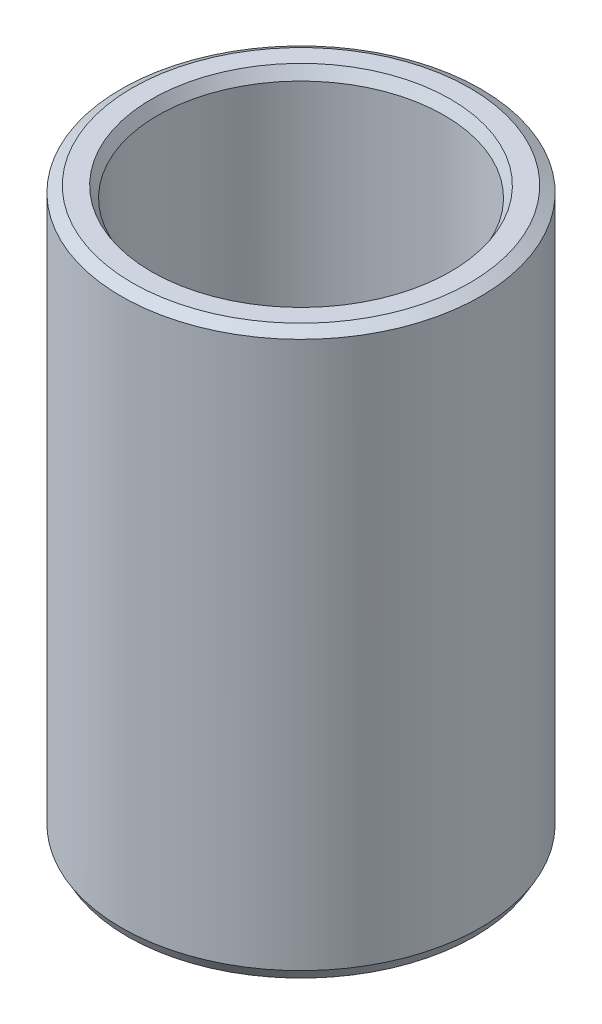
ISO-10303-21;
HEADER;
FILE_DESCRIPTION(('STEP AP214'),'2;1');
FILE_NAME('part.step','',(''),(''),'','','');
FILE_SCHEMA(('AUTOMOTIVE_DESIGN { 1 0 10303 214 1 1 1 1 }'));
ENDSEC;
DATA;
#1=APPLICATION_CONTEXT('core data for automotive mechanical design processes');
#2=APPLICATION_PROTOCOL_DEFINITION('international standard','automotive_design',2000,#1);
#3=PRODUCT_CONTEXT('',#1,'mechanical');
#4=PRODUCT('Part','Part','',(#3));
#5=PRODUCT_RELATED_PRODUCT_CATEGORY('part','',(#4));
#6=PRODUCT_DEFINITION_FORMATION('','',#4);
#7=PRODUCT_DEFINITION_CONTEXT('part definition',#1,'design');
#8=PRODUCT_DEFINITION('design','',#6,#7);
#9=PRODUCT_DEFINITION_SHAPE('','',#8);
#10=(LENGTH_UNIT() NAMED_UNIT(*) SI_UNIT(.MILLI.,.METRE.));
#11=(NAMED_UNIT(*) PLANE_ANGLE_UNIT() SI_UNIT($,.RADIAN.));
#12=(NAMED_UNIT(*) SI_UNIT($,.STERADIAN.) SOLID_ANGLE_UNIT());
#13=UNCERTAINTY_MEASURE_WITH_UNIT(LENGTH_MEASURE(1.E-05),#10,'distance_accuracy_value','');
#14=(GEOMETRIC_REPRESENTATION_CONTEXT(3) GLOBAL_UNCERTAINTY_ASSIGNED_CONTEXT((#13)) GLOBAL_UNIT_ASSIGNED_CONTEXT((#10,
#11,#12)) REPRESENTATION_CONTEXT('',''));
#15=CARTESIAN_POINT('',(0.,0.,0.));
#16=DIRECTION('',(0.,0.,1.));
#17=DIRECTION('',(1.,0.,0.));
#18=AXIS2_PLACEMENT_3D('',#15,#16,#17);
#19=CARTESIAN_POINT('',(0.,78.4503649466018,0.));
#20=DIRECTION('',(0.,-1.,0.));
#21=DIRECTION('',(0.,0.,-1.));
#22=AXIS2_PLACEMENT_3D('',#19,#20,#21);
#23=CYLINDRICAL_SURFACE('',#22,25.);
#24=CARTESIAN_POINT('',(0.,1.51550329180392,0.));
#25=DIRECTION('',(0.,1.,0.));
#26=DIRECTION('',(0.,0.,1.));
#27=AXIS2_PLACEMENT_3D('',#24,#25,#26);
#28=CIRCLE('',#27,25.);
#29=CARTESIAN_POINT('',(0.,1.51550329180392,-25.));
#30=VERTEX_POINT('',#29);
#31=EDGE_CURVE('E10',#30,#30,#28,.T.);
#32=CARTESIAN_POINT('',(0.,77.5753887131211,0.));
#33=DIRECTION('',(0.,1.,0.));
#34=DIRECTION('',(0.,0.,1.));
#35=AXIS2_PLACEMENT_3D('',#32,#33,#34);
#36=CIRCLE('',#35,25.);
#37=CARTESIAN_POINT('',(0.,77.5753887131211,-25.));
#38=VERTEX_POINT('',#37);
#39=EDGE_CURVE('E50',#38,#38,#36,.F.);
#40=CARTESIAN_POINT('',(0.,1.51550329180392,-25.));
#41=CARTESIAN_POINT('',(0.,2.30779376494263,-25.));
#42=CARTESIAN_POINT('',(0.,3.10008423808135,-25.));
#43=CARTESIAN_POINT('',(0.,4.6846651843588,-25.));
#44=CARTESIAN_POINT('',(0.,5.47695565749752,-25.));
#45=CARTESIAN_POINT('',(0.,7.06153660377496,-25.));
#46=CARTESIAN_POINT('',(0.,7.85382707691368,-25.));
#47=CARTESIAN_POINT('',(0.,9.43840802319112,-25.));
#48=CARTESIAN_POINT('',(0.,10.2306984963298,-25.));
#49=CARTESIAN_POINT('',(0.,11.8152794426073,-25.));
#50=CARTESIAN_POINT('',(0.,12.607569915746,-25.));
#51=CARTESIAN_POINT('',(0.,14.1921508620234,-25.));
#52=CARTESIAN_POINT('',(0.,14.9844413351622,-25.));
#53=CARTESIAN_POINT('',(0.,16.5690222814396,-25.));
#54=CARTESIAN_POINT('',(0.,17.3613127545783,-25.));
#55=CARTESIAN_POINT('',(0.,18.9458937008558,-25.));
#56=CARTESIAN_POINT('',(0.,19.7381841739945,-25.));
#57=CARTESIAN_POINT('',(0.,21.3227651202719,-25.));
#58=CARTESIAN_POINT('',(0.,22.1150555934106,-25.));
#59=CARTESIAN_POINT('',(0.,23.6996365396881,-25.));
#60=CARTESIAN_POINT('',(0.,24.4919270128268,-25.));
#61=CARTESIAN_POINT('',(0.,26.0765079591042,-25.));
#62=CARTESIAN_POINT('',(0.,26.868798432243,-25.));
#63=CARTESIAN_POINT('',(0.,28.4533793785204,-25.));
#64=CARTESIAN_POINT('',(0.,29.2456698516591,-25.));
#65=CARTESIAN_POINT('',(0.,30.8302507979366,-25.));
#66=CARTESIAN_POINT('',(0.,31.6225412710753,-25.));
#67=CARTESIAN_POINT('',(0.,33.2071222173527,-25.));
#68=CARTESIAN_POINT('',(0.,33.9994126904914,-25.));
#69=CARTESIAN_POINT('',(0.,35.5839936367689,-25.));
#70=CARTESIAN_POINT('',(0.,36.3762841099076,-25.));
#71=CARTESIAN_POINT('',(0.,37.960865056185,-25.));
#72=CARTESIAN_POINT('',(0.,38.7531555293238,-25.));
#73=CARTESIAN_POINT('',(0.,40.3377364756012,-25.));
#74=CARTESIAN_POINT('',(0.,41.1300269487399,-25.));
#75=CARTESIAN_POINT('',(0.,42.7146078950174,-25.));
#76=CARTESIAN_POINT('',(0.,43.5068983681561,-25.));
#77=CARTESIAN_POINT('',(0.,45.0914793144335,-25.));
#78=CARTESIAN_POINT('',(0.,45.8837697875723,-25.));
#79=CARTESIAN_POINT('',(0.,47.4683507338497,-25.));
#80=CARTESIAN_POINT('',(0.,48.2606412069884,-25.));
#81=CARTESIAN_POINT('',(0.,49.8452221532659,-25.));
#82=CARTESIAN_POINT('',(0.,50.6375126264046,-25.));
#83=CARTESIAN_POINT('',(0.,52.222093572682,-25.));
#84=CARTESIAN_POINT('',(0.,53.0143840458207,-25.));
#85=CARTESIAN_POINT('',(0.,54.5989649920982,-25.));
#86=CARTESIAN_POINT('',(0.,55.3912554652369,-25.));
#87=CARTESIAN_POINT('',(0.,56.9758364115143,-25.));
#88=CARTESIAN_POINT('',(0.,57.7681268846531,-25.));
#89=CARTESIAN_POINT('',(0.,59.3527078309305,-25.));
#90=CARTESIAN_POINT('',(0.,60.1449983040692,-25.));
#91=CARTESIAN_POINT('',(0.,61.7295792503467,-25.));
#92=CARTESIAN_POINT('',(0.,62.5218697234854,-25.));
#93=CARTESIAN_POINT('',(0.,64.1064506697628,-25.));
#94=CARTESIAN_POINT('',(0.,64.8987411429015,-25.));
#95=CARTESIAN_POINT('',(0.,66.483322089179,-25.));
#96=CARTESIAN_POINT('',(0.,67.2756125623177,-25.));
#97=CARTESIAN_POINT('',(0.,68.8601935085951,-25.));
#98=CARTESIAN_POINT('',(0.,69.6524839817339,-25.));
#99=CARTESIAN_POINT('',(0.,71.2370649280113,-25.));
#100=CARTESIAN_POINT('',(0.,72.02935540115,-25.));
#101=CARTESIAN_POINT('',(0.,73.6139363474275,-25.));
#102=CARTESIAN_POINT('',(0.,74.4062268205662,-25.));
#103=CARTESIAN_POINT('',(0.,75.9908077668436,-25.));
#104=CARTESIAN_POINT('',(0.,76.7830982399824,-25.));
#105=CARTESIAN_POINT('',(0.,77.5753887131211,-25.));
#106=B_SPLINE_CURVE_WITH_KNOTS('',3,(#40,#41,#42,#43,#44,#45,#46,#47,#48,#49,#50,#51,#52,#53,
#54,#55,#56,#57,#58,#59,#60,#61,#62,#63,#64,#65,#66,#67,#68,#69,#70,#71,#72,#73,#74,#75,#76,#77,
#78,#79,#80,#81,#82,#83,#84,#85,#86,#87,#88,#89,#90,#91,#92,#93,#94,#95,#96,#97,#98,#99,#100,
#101,#102,#103,#104,#105),.UNSPECIFIED.,.F.,.F.,(4,2,2,2,2,2,2,2,2,2,2,2,2,2,2,2,2,2,2,2,2,2,2,
2,2,2,2,2,2,2,2,2,4),(0.,2.37687141941616,4.75374283883233,7.13061425824849,9.50748567766464,
11.8843570970808,14.261228516497,16.6380999359131,19.0149713553293,21.3918427747454,
23.7687141941616,26.1455856135778,28.5224570329939,30.8993284524101,33.2761998718263,
35.6530712912424,38.0299427106586,40.4068141300747,42.7836855494909,45.1605569689071,
47.5374283883232,49.9142998077394,52.2911712271555,54.6680426465717,57.0449140659879,
59.421785485404,61.7986569048202,64.1755283242363,66.5523997436525,68.9292711630687,
71.3061425824848,73.683014001901,76.0598854213172),.UNSPECIFIED.);
#107=EDGE_CURVE('BSEAM39',#30,#38,#106,.T.);
#108=ORIENTED_EDGE('',*,*,#31,.T.);
#109=ORIENTED_EDGE('',*,*,#39,.T.);
#110=ORIENTED_EDGE('',*,*,#107,.T.);
#111=ORIENTED_EDGE('',*,*,#107,.F.);
#112=EDGE_LOOP('',(#108,#110,#109,#111));
#113=FACE_BOUND('',#112,.T.);
#114=ADVANCED_FACE('F39',(#113),#23,.T.);
#115=CARTESIAN_POINT('',(0.,78.4503649466018,0.));
#116=DIRECTION('',(0.,1.,0.));
#117=DIRECTION('',(0.,0.,1.));
#118=AXIS2_PLACEMENT_3D('',#115,#116,#117);
#119=PLANE('',#118);
#120=CARTESIAN_POINT('',(0.,78.4503649466018,0.));
#121=DIRECTION('',(0.,1.,0.));
#122=DIRECTION('',(0.,0.,1.));
#123=AXIS2_PLACEMENT_3D('',#120,#121,#122);
#124=CIRCLE('',#123,20.7973479572529);
#125=CARTESIAN_POINT('',(0.,78.4503649466018,20.7973479572529));
#126=VERTEX_POINT('',#125);
#127=EDGE_CURVE('E58',#126,#126,#124,.F.);
#128=ORIENTED_EDGE('',*,*,#127,.T.);
#129=EDGE_LOOP('',(#128));
#130=FACE_BOUND('',#129,.T.);
#131=CARTESIAN_POINT('',(0.,78.4503649466018,0.));
#132=DIRECTION('',(0.,1.,0.));
#133=DIRECTION('',(0.,0.,1.));
#134=AXIS2_PLACEMENT_3D('',#131,#132,#133);
#135=CIRCLE('',#134,23.4844967081963);
#136=CARTESIAN_POINT('',(0.,78.4503649466018,23.4844967081963));
#137=VERTEX_POINT('',#136);
#138=EDGE_CURVE('E61',#137,#137,#135,.T.);
#139=ORIENTED_EDGE('',*,*,#138,.T.);
#140=EDGE_LOOP('',(#139));
#141=FACE_BOUND('',#140,.T.);
#142=ADVANCED_FACE('F88',(#130,#141),#119,.T.);
#143=CARTESIAN_POINT('',(0.,0.,0.));
#144=DIRECTION('',(0.,1.,0.));
#145=DIRECTION('',(0.,0.,1.));
#146=AXIS2_PLACEMENT_3D('',#143,#144,#145);
#147=PLANE('',#146);
#148=CARTESIAN_POINT('',(0.,0.,0.));
#149=DIRECTION('',(0.,1.,0.));
#150=DIRECTION('',(0.,0.,1.));
#151=AXIS2_PLACEMENT_3D('',#148,#149,#150);
#152=CIRCLE('',#151,21.4378750155759);
#153=CARTESIAN_POINT('',(0.,0.,21.4378750155759));
#154=VERTEX_POINT('',#153);
#155=EDGE_CURVE('E51',#154,#154,#152,.T.);
#156=ORIENTED_EDGE('',*,*,#155,.T.);
#157=EDGE_LOOP('',(#156));
#158=FACE_BOUND('',#157,.T.);
#159=CARTESIAN_POINT('',(0.,0.,0.));
#160=DIRECTION('',(0.,1.,0.));
#161=DIRECTION('',(0.,0.,1.));
#162=AXIS2_PLACEMENT_3D('',#159,#160,#161);
#163=CIRCLE('',#162,24.1250237665192);
#164=CARTESIAN_POINT('',(0.,0.,24.1250237665192));
#165=VERTEX_POINT('',#164);
#166=EDGE_CURVE('E54',#165,#165,#163,.F.);
#167=ORIENTED_EDGE('',*,*,#166,.T.);
#168=EDGE_LOOP('',(#167));
#169=FACE_BOUND('',#168,.T.);
#170=ADVANCED_FACE('F83',(#158,#169),#147,.F.);
#171=CARTESIAN_POINT('',(0.,78.4503649466018,0.));
#172=DIRECTION('',(0.,-1.,0.));
#173=DIRECTION('',(0.,0.,-1.));
#174=AXIS2_PLACEMENT_3D('',#171,#172,#173);
#175=CYLINDRICAL_SURFACE('',#174,19.9223717237721);
#176=CARTESIAN_POINT('',(0.,76.9348616547978,0.));
#177=DIRECTION('',(0.,1.,0.));
#178=DIRECTION('',(0.,0.,1.));
#179=AXIS2_PLACEMENT_3D('',#176,#177,#178);
#180=CIRCLE('',#179,19.9223717237721);
#181=CARTESIAN_POINT('',(0.,76.9348616547978,-19.9223717237721));
#182=VERTEX_POINT('',#181);
#183=EDGE_CURVE('E67',#182,#182,#180,.T.);
#184=CARTESIAN_POINT('',(0.,0.874976233480679,0.));
#185=DIRECTION('',(0.,1.,0.));
#186=DIRECTION('',(0.,0.,1.));
#187=AXIS2_PLACEMENT_3D('',#184,#185,#186);
#188=CIRCLE('',#187,19.9223717237721);
#189=CARTESIAN_POINT('',(0.,0.874976233480679,-19.9223717237721));
#190=VERTEX_POINT('',#189);
#191=EDGE_CURVE('E69',#190,#190,#188,.F.);
#192=CARTESIAN_POINT('',(0.,76.9348616547978,-19.9223717237721));
#193=CARTESIAN_POINT('',(0.,76.1425711816591,-19.9223717237721));
#194=CARTESIAN_POINT('',(0.,75.3502807085204,-19.9223717237721));
#195=CARTESIAN_POINT('',(0.,73.765699762243,-19.9223717237721));
#196=CARTESIAN_POINT('',(0.,72.9734092891042,-19.9223717237721));
#197=CARTESIAN_POINT('',(0.,71.3888283428268,-19.9223717237721));
#198=CARTESIAN_POINT('',(0.,70.5965378696881,-19.9223717237721));
#199=CARTESIAN_POINT('',(0.,69.0119569234106,-19.9223717237721));
#200=CARTESIAN_POINT('',(0.,68.2196664502719,-19.9223717237721));
#201=CARTESIAN_POINT('',(0.,66.6350855039945,-19.9223717237721));
#202=CARTESIAN_POINT('',(0.,65.8427950308558,-19.9223717237721));
#203=CARTESIAN_POINT('',(0.,64.2582140845783,-19.9223717237721));
#204=CARTESIAN_POINT('',(0.,63.4659236114396,-19.9223717237721));
#205=CARTESIAN_POINT('',(0.,61.8813426651622,-19.9223717237721));
#206=CARTESIAN_POINT('',(0.,61.0890521920234,-19.9223717237721));
#207=CARTESIAN_POINT('',(0.,59.504471245746,-19.9223717237721));
#208=CARTESIAN_POINT('',(0.,58.7121807726073,-19.9223717237721));
#209=CARTESIAN_POINT('',(0.,57.1275998263298,-19.9223717237721));
#210=CARTESIAN_POINT('',(0.,56.3353093531911,-19.9223717237721));
#211=CARTESIAN_POINT('',(0.,54.7507284069137,-19.9223717237721));
#212=CARTESIAN_POINT('',(0.,53.958437933775,-19.9223717237721));
#213=CARTESIAN_POINT('',(0.,52.3738569874975,-19.9223717237721));
#214=CARTESIAN_POINT('',(0.,51.5815665143588,-19.9223717237721));
#215=CARTESIAN_POINT('',(0.,49.9969855680813,-19.9223717237721));
#216=CARTESIAN_POINT('',(0.,49.2046950949426,-19.9223717237721));
#217=CARTESIAN_POINT('',(0.,47.6201141486652,-19.9223717237721));
#218=CARTESIAN_POINT('',(0.,46.8278236755265,-19.9223717237721));
#219=CARTESIAN_POINT('',(0.,45.243242729249,-19.9223717237721));
#220=CARTESIAN_POINT('',(0.,44.4509522561103,-19.9223717237721));
#221=CARTESIAN_POINT('',(0.,42.8663713098329,-19.9223717237721));
#222=CARTESIAN_POINT('',(0.,42.0740808366941,-19.9223717237721));
#223=CARTESIAN_POINT('',(0.,40.4894998904167,-19.9223717237721));
#224=CARTESIAN_POINT('',(0.,39.697209417278,-19.9223717237721));
#225=CARTESIAN_POINT('',(0.,38.1126284710005,-19.9223717237721));
#226=CARTESIAN_POINT('',(0.,37.3203379978618,-19.9223717237721));
#227=CARTESIAN_POINT('',(0.,35.7357570515844,-19.9223717237721));
#228=CARTESIAN_POINT('',(0.,34.9434665784457,-19.9223717237721));
#229=CARTESIAN_POINT('',(0.,33.3588856321682,-19.9223717237721));
#230=CARTESIAN_POINT('',(0.,32.5665951590295,-19.9223717237721));
#231=CARTESIAN_POINT('',(0.,30.9820142127521,-19.9223717237721));
#232=CARTESIAN_POINT('',(0.,30.1897237396133,-19.9223717237721));
#233=CARTESIAN_POINT('',(0.,28.6051427933359,-19.9223717237721));
#234=CARTESIAN_POINT('',(0.,27.8128523201972,-19.9223717237721));
#235=CARTESIAN_POINT('',(0.,26.2282713739197,-19.9223717237721));
#236=CARTESIAN_POINT('',(0.,25.435980900781,-19.9223717237721));
#237=CARTESIAN_POINT('',(0.,23.8513999545036,-19.9223717237721));
#238=CARTESIAN_POINT('',(0.,23.0591094813649,-19.9223717237721));
#239=CARTESIAN_POINT('',(0.,21.4745285350874,-19.9223717237721));
#240=CARTESIAN_POINT('',(0.,20.6822380619487,-19.9223717237721));
#241=CARTESIAN_POINT('',(0.,19.0976571156713,-19.9223717237721));
#242=CARTESIAN_POINT('',(0.,18.3053666425325,-19.9223717237721));
#243=CARTESIAN_POINT('',(0.,16.7207856962551,-19.9223717237721));
#244=CARTESIAN_POINT('',(0.,15.9284952231164,-19.9223717237721));
#245=CARTESIAN_POINT('',(0.,14.3439142768389,-19.9223717237721));
#246=CARTESIAN_POINT('',(0.,13.5516238037002,-19.9223717237721));
#247=CARTESIAN_POINT('',(0.,11.9670428574228,-19.9223717237721));
#248=CARTESIAN_POINT('',(0.,11.174752384284,-19.9223717237721));
#249=CARTESIAN_POINT('',(0.,9.5901714380066,-19.9223717237721));
#250=CARTESIAN_POINT('',(0.,8.79788096486788,-19.9223717237721));
#251=CARTESIAN_POINT('',(0.,7.21330001859045,-19.9223717237721));
#252=CARTESIAN_POINT('',(0.,6.42100954545173,-19.9223717237721));
#253=CARTESIAN_POINT('',(0.,4.83642859917428,-19.9223717237721));
#254=CARTESIAN_POINT('',(0.,4.04413812603556,-19.9223717237721));
#255=CARTESIAN_POINT('',(0.,2.45955717975812,-19.9223717237721));
#256=CARTESIAN_POINT('',(0.,1.6672667066194,-19.9223717237721));
#257=CARTESIAN_POINT('',(0.,0.874976233480679,-19.9223717237721));
#258=B_SPLINE_CURVE_WITH_KNOTS('',3,(#192,#193,#194,#195,#196,#197,#198,#199,#200,#201,#202,
#203,#204,#205,#206,#207,#208,#209,#210,#211,#212,#213,#214,#215,#216,#217,#218,#219,#220,#221,
#222,#223,#224,#225,#226,#227,#228,#229,#230,#231,#232,#233,#234,#235,#236,#237,#238,#239,#240,
#241,#242,#243,#244,#245,#246,#247,#248,#249,#250,#251,#252,#253,#254,#255,#256,#257),
.UNSPECIFIED.,.F.,.F.,(4,2,2,2,2,2,2,2,2,2,2,2,2,2,2,2,2,2,2,2,2,2,2,2,2,2,2,2,2,2,2,2,4),(0.,
2.37687141941616,4.75374283883231,7.13061425824847,9.50748567766464,11.8843570970808,
14.261228516497,16.6380999359131,19.0149713553293,21.3918427747454,23.7687141941616,
26.1455856135778,28.5224570329939,30.8993284524101,33.2761998718263,35.6530712912424,
38.0299427106586,40.4068141300747,42.7836855494909,45.1605569689071,47.5374283883232,
49.9142998077394,52.2911712271555,54.6680426465717,57.0449140659879,59.421785485404,
61.7986569048202,64.1755283242363,66.5523997436525,68.9292711630687,71.3061425824848,
73.683014001901,76.0598854213172),.UNSPECIFIED.);
#259=EDGE_CURVE('BSEAM71',#182,#190,#258,.T.);
#260=ORIENTED_EDGE('',*,*,#183,.T.);
#261=ORIENTED_EDGE('',*,*,#191,.T.);
#262=ORIENTED_EDGE('',*,*,#259,.T.);
#263=ORIENTED_EDGE('',*,*,#259,.F.);
#264=EDGE_LOOP('',(#260,#262,#261,#263));
#265=FACE_BOUND('',#264,.T.);
#266=ADVANCED_FACE('F71',(#265),#175,.F.);
#267=CARTESIAN_POINT('',(0.,76.9348616547978,0.));
#268=DIRECTION('',(0.,1.,0.));
#269=DIRECTION('',(0.,0.,1.));
#270=AXIS2_PLACEMENT_3D('',#267,#268,#269);
#271=CONICAL_SURFACE('',#270,19.9223717237721,0.523598775598303);
#272=ORIENTED_EDGE('',*,*,#127,.F.);
#273=EDGE_LOOP('',(#272));
#274=FACE_BOUND('',#273,.T.);
#275=ORIENTED_EDGE('',*,*,#183,.F.);
#276=EDGE_LOOP('',(#275));
#277=FACE_BOUND('',#276,.T.);
#278=ADVANCED_FACE('F77',(#274,#277),#271,.F.);
#279=CARTESIAN_POINT('',(0.,0.,0.));
#280=DIRECTION('',(0.,-1.,0.));
#281=DIRECTION('',(0.,0.,-1.));
#282=AXIS2_PLACEMENT_3D('',#279,#280,#281);
#283=CONICAL_SURFACE('',#282,21.4378750155759,1.0471975511966);
#284=ORIENTED_EDGE('',*,*,#191,.F.);
#285=EDGE_LOOP('',(#284));
#286=FACE_BOUND('',#285,.T.);
#287=ORIENTED_EDGE('',*,*,#155,.F.);
#288=EDGE_LOOP('',(#287));
#289=FACE_BOUND('',#288,.T.);
#290=ADVANCED_FACE('F73',(#286,#289),#283,.F.);
#291=CARTESIAN_POINT('',(0.,1.51550329180392,0.));
#292=DIRECTION('',(0.,1.,0.));
#293=DIRECTION('',(0.,0.,1.));
#294=AXIS2_PLACEMENT_3D('',#291,#292,#293);
#295=CONICAL_SURFACE('',#294,25.,0.523598775598302);
#296=ORIENTED_EDGE('',*,*,#166,.F.);
#297=EDGE_LOOP('',(#296));
#298=FACE_BOUND('',#297,.T.);
#299=ORIENTED_EDGE('',*,*,#31,.F.);
#300=EDGE_LOOP('',(#299));
#301=FACE_BOUND('',#300,.T.);
#302=ADVANCED_FACE('F76',(#298,#301),#295,.T.);
#303=CARTESIAN_POINT('',(0.,78.4503649466018,0.));
#304=DIRECTION('',(0.,-1.,0.));
#305=DIRECTION('',(0.,0.,-1.));
#306=AXIS2_PLACEMENT_3D('',#303,#304,#305);
#307=CONICAL_SURFACE('',#306,23.4844967081963,1.04719755119659);
#308=ORIENTED_EDGE('',*,*,#39,.F.);
#309=EDGE_LOOP('',(#308));
#310=FACE_BOUND('',#309,.T.);
#311=ORIENTED_EDGE('',*,*,#138,.F.);
#312=EDGE_LOOP('',(#311));
#313=FACE_BOUND('',#312,.T.);
#314=ADVANCED_FACE('F45',(#310,#313),#307,.T.);
#315=CLOSED_SHELL('',(#114,#142,#170,#266,#278,#290,#302,#314));
#316=MANIFOLD_SOLID_BREP('B2',#315);
#317=ADVANCED_BREP_SHAPE_REPRESENTATION('',(#18,#316),#14);
#318=SHAPE_DEFINITION_REPRESENTATION(#9,#317);
ENDSEC;
END-ISO-10303-21;
